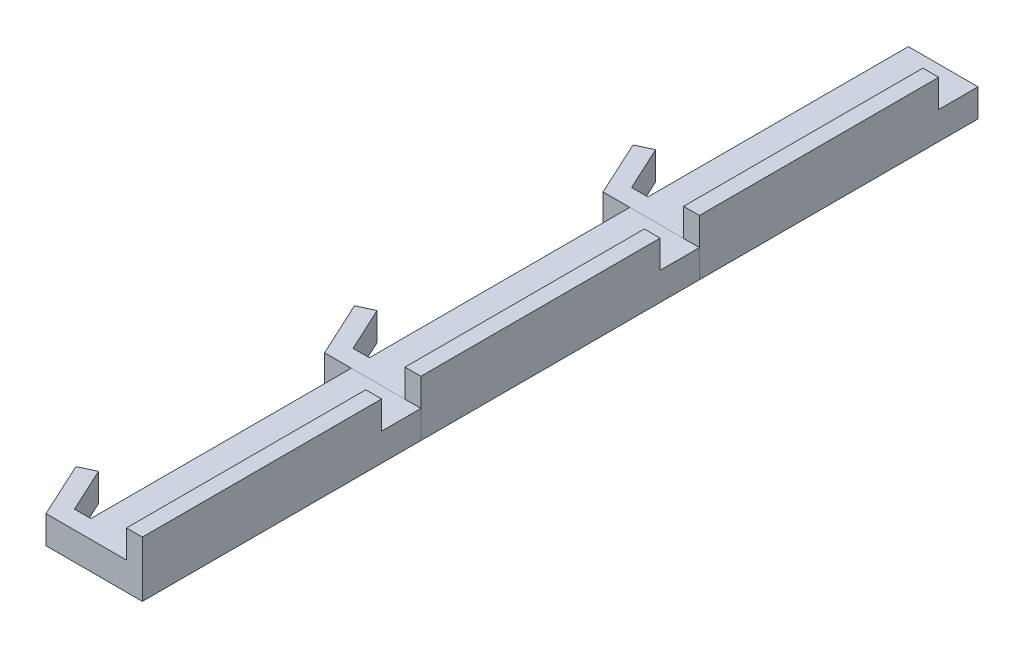
ISO-10303-21;
HEADER;
FILE_DESCRIPTION(('STEP AP214'),'2;1');
FILE_NAME('part.step','',(''),(''),'','','');
FILE_SCHEMA(('AUTOMOTIVE_DESIGN { 1 0 10303 214 1 1 1 1 }'));
ENDSEC;
DATA;
#1=APPLICATION_CONTEXT('core data for automotive mechanical design processes');
#2=APPLICATION_PROTOCOL_DEFINITION('international standard','automotive_design',2000,#1);
#3=PRODUCT_CONTEXT('',#1,'mechanical');
#4=PRODUCT('Part','Part','',(#3));
#5=PRODUCT_RELATED_PRODUCT_CATEGORY('part','',(#4));
#6=PRODUCT_DEFINITION_FORMATION('','',#4);
#7=PRODUCT_DEFINITION_CONTEXT('part definition',#1,'design');
#8=PRODUCT_DEFINITION('design','',#6,#7);
#9=PRODUCT_DEFINITION_SHAPE('','',#8);
#10=(LENGTH_UNIT() NAMED_UNIT(*) SI_UNIT(.MILLI.,.METRE.));
#11=(NAMED_UNIT(*) PLANE_ANGLE_UNIT() SI_UNIT($,.RADIAN.));
#12=(NAMED_UNIT(*) SI_UNIT($,.STERADIAN.) SOLID_ANGLE_UNIT());
#13=UNCERTAINTY_MEASURE_WITH_UNIT(LENGTH_MEASURE(1.E-05),#10,'distance_accuracy_value','');
#14=(GEOMETRIC_REPRESENTATION_CONTEXT(3) GLOBAL_UNCERTAINTY_ASSIGNED_CONTEXT((#13)) GLOBAL_UNIT_ASSIGNED_CONTEXT((#10,
#11,#12)) REPRESENTATION_CONTEXT('',''));
#15=CARTESIAN_POINT('',(0.,0.,0.));
#16=DIRECTION('',(0.,0.,1.));
#17=DIRECTION('',(1.,0.,0.));
#18=AXIS2_PLACEMENT_3D('',#15,#16,#17);
#19=CARTESIAN_POINT('',(0.,5.,-200.));
#20=DIRECTION('',(0.,-1.,0.));
#21=DIRECTION('',(0.,0.,-1.));
#22=AXIS2_PLACEMENT_3D('',#19,#20,#21);
#23=PLANE('',#22);
#24=DIRECTION('',(0.,0.,1.));
#25=VECTOR('',#24,1.);
#26=CARTESIAN_POINT('',(19.3056635281437,5.,-200.));
#27=LINE('',#26,#25);
#28=CARTESIAN_POINT('',(19.3056635281437,5.,-285.89851116357));
#29=VERTEX_POINT('',#28);
#30=CARTESIAN_POINT('',(19.3056635281437,5.,-200.));
#31=VERTEX_POINT('',#30);
#32=EDGE_CURVE('E152',#29,#31,#27,.T.);
#33=ORIENTED_EDGE('',*,*,#32,.F.);
#34=DIRECTION('',(-1.,0.,0.));
#35=VECTOR('',#34,1.);
#36=CARTESIAN_POINT('',(25.,5.,-285.89851116357));
#37=LINE('',#36,#35);
#38=CARTESIAN_POINT('',(25.,5.,-285.89851116357));
#39=VERTEX_POINT('',#38);
#40=EDGE_CURVE('E67',#39,#29,#37,.T.);
#41=ORIENTED_EDGE('',*,*,#40,.F.);
#42=DIRECTION('',(0.,0.,-1.));
#43=VECTOR('',#42,1.);
#44=CARTESIAN_POINT('',(25.,5.,-200.));
#45=LINE('',#44,#43);
#46=CARTESIAN_POINT('',(25.,5.,-300.));
#47=VERTEX_POINT('',#46);
#48=EDGE_CURVE('E156',#39,#47,#45,.T.);
#49=ORIENTED_EDGE('',*,*,#48,.T.);
#50=DIRECTION('',(-1.,0.,0.));
#51=VECTOR('',#50,1.);
#52=CARTESIAN_POINT('',(0.,5.,-300.));
#53=LINE('',#52,#51);
#54=CARTESIAN_POINT('',(0.,5.,-300.));
#55=VERTEX_POINT('',#54);
#56=EDGE_CURVE('E222',#47,#55,#53,.T.);
#57=ORIENTED_EDGE('',*,*,#56,.T.);
#58=DIRECTION('',(0.,0.,1.));
#59=VECTOR('',#58,1.);
#60=CARTESIAN_POINT('',(0.,5.,-200.));
#61=LINE('',#60,#59);
#62=CARTESIAN_POINT('',(0.,5.,-206.505696114862));
#63=VERTEX_POINT('',#62);
#64=EDGE_CURVE('E217',#55,#63,#61,.T.);
#65=ORIENTED_EDGE('',*,*,#64,.T.);
#66=DIRECTION('',(-1.,0.,0.));
#67=VECTOR('',#66,1.);
#68=CARTESIAN_POINT('',(-5.86936831603831,5.,-206.505696114862));
#69=LINE('',#68,#67);
#70=CARTESIAN_POINT('',(-5.86936831603831,5.,-206.505696114862));
#71=VERTEX_POINT('',#70);
#72=EDGE_CURVE('E157',#63,#71,#69,.T.);
#73=ORIENTED_EDGE('',*,*,#72,.T.);
#74=DIRECTION('',(-0.419954440524042,0.,-0.907545187791847));
#75=VECTOR('',#74,1.);
#76=CARTESIAN_POINT('',(-13.2983834469383,5.,-222.560216037708));
#77=LINE('',#76,#75);
#78=CARTESIAN_POINT('',(-13.2983834469383,5.,-222.560216037708));
#79=VERTEX_POINT('',#78);
#80=EDGE_CURVE('E160',#71,#79,#77,.T.);
#81=ORIENTED_EDGE('',*,*,#80,.T.);
#82=DIRECTION('',(-0.907545187791847,0.,0.419954440524042));
#83=VECTOR('',#82,1.);
#84=CARTESIAN_POINT('',(-18.8458423088671,5.,-219.993203381997));
#85=LINE('',#84,#83);
#86=CARTESIAN_POINT('',(-18.8458423088671,5.,-219.993203381997));
#87=VERTEX_POINT('',#86);
#88=EDGE_CURVE('E178',#79,#87,#85,.T.);
#89=ORIENTED_EDGE('',*,*,#88,.T.);
#90=DIRECTION('',(0.419954440524043,0.,0.907545187791847));
#91=VECTOR('',#90,1.);
#92=CARTESIAN_POINT('',(-9.59425389925973,5.,-200.));
#93=LINE('',#92,#91);
#94=CARTESIAN_POINT('',(-9.59425389925973,5.,-200.));
#95=VERTEX_POINT('',#94);
#96=EDGE_CURVE('E175',#87,#95,#93,.T.);
#97=ORIENTED_EDGE('',*,*,#96,.T.);
#98=DIRECTION('',(1.,0.,0.));
#99=VECTOR('',#98,1.);
#100=CARTESIAN_POINT('',(0.,5.,-200.));
#101=LINE('',#100,#99);
#102=EDGE_CURVE('E73',#95,#31,#101,.T.);
#103=ORIENTED_EDGE('',*,*,#102,.T.);
#104=EDGE_LOOP('',(#33,#41,#49,#57,#65,#73,#81,#89,#97,#103));
#105=FACE_BOUND('',#104,.T.);
#106=ADVANCED_FACE('F50',(#105),#23,.F.);
#107=CARTESIAN_POINT('',(0.,5.,-200.));
#108=DIRECTION('',(1.,0.,0.));
#109=DIRECTION('',(0.,0.,-1.));
#110=AXIS2_PLACEMENT_3D('',#107,#108,#109);
#111=PLANE('',#110);
#112=DIRECTION('',(0.,0.,1.));
#113=VECTOR('',#112,1.);
#114=CARTESIAN_POINT('',(0.,-5.,-200.));
#115=LINE('',#114,#113);
#116=CARTESIAN_POINT('',(0.,-5.,-300.));
#117=VERTEX_POINT('',#116);
#118=CARTESIAN_POINT('',(0.,-5.,-206.505696114862));
#119=VERTEX_POINT('',#118);
#120=EDGE_CURVE('E210',#117,#119,#115,.T.);
#121=ORIENTED_EDGE('',*,*,#120,.T.);
#122=DIRECTION('',(0.,1.,0.));
#123=VECTOR('',#122,1.);
#124=CARTESIAN_POINT('',(0.,-34.3960732071268,-206.505696114862));
#125=LINE('',#124,#123);
#126=EDGE_CURVE('E198',#119,#63,#125,.T.);
#127=ORIENTED_EDGE('',*,*,#126,.T.);
#128=ORIENTED_EDGE('',*,*,#64,.F.);
#129=DIRECTION('',(0.,-1.,0.));
#130=VECTOR('',#129,1.);
#131=CARTESIAN_POINT('',(0.,5.,-300.));
#132=LINE('',#131,#130);
#133=EDGE_CURVE('E224',#55,#117,#132,.T.);
#134=ORIENTED_EDGE('',*,*,#133,.T.);
#135=EDGE_LOOP('',(#121,#127,#128,#134));
#136=FACE_BOUND('',#135,.T.);
#137=ADVANCED_FACE('F52',(#136),#111,.F.);
#138=CARTESIAN_POINT('',(0.,5.,-200.));
#139=DIRECTION('',(0.,0.,-1.));
#140=DIRECTION('',(-1.,0.,0.));
#141=AXIS2_PLACEMENT_3D('',#138,#139,#140);
#142=PLANE('',#141);
#143=DIRECTION('',(1.,0.,0.));
#144=VECTOR('',#143,1.);
#145=CARTESIAN_POINT('',(0.,-5.,-200.));
#146=LINE('',#145,#144);
#147=CARTESIAN_POINT('',(-9.59425389925973,-5.,-200.));
#148=VERTEX_POINT('',#147);
#149=CARTESIAN_POINT('',(25.,-5.,-200.));
#150=VERTEX_POINT('',#149);
#151=EDGE_CURVE('E227',#148,#150,#146,.T.);
#152=ORIENTED_EDGE('',*,*,#151,.T.);
#153=DIRECTION('',(0.,-1.,0.));
#154=VECTOR('',#153,1.);
#155=CARTESIAN_POINT('',(25.,5.,-200.));
#156=LINE('',#155,#154);
#157=CARTESIAN_POINT('',(25.,15.,-200.));
#158=VERTEX_POINT('',#157);
#159=EDGE_CURVE('E12',#158,#150,#156,.T.);
#160=ORIENTED_EDGE('',*,*,#159,.F.);
#161=DIRECTION('',(1.,0.,0.));
#162=VECTOR('',#161,1.);
#163=CARTESIAN_POINT('',(25.,15.,-200.));
#164=LINE('',#163,#162);
#165=CARTESIAN_POINT('',(19.3056635281437,15.,-200.));
#166=VERTEX_POINT('',#165);
#167=EDGE_CURVE('E150',#166,#158,#164,.T.);
#168=ORIENTED_EDGE('',*,*,#167,.F.);
#169=DIRECTION('',(0.,-1.,0.));
#170=VECTOR('',#169,1.);
#171=CARTESIAN_POINT('',(19.3056635281437,15.,-200.));
#172=LINE('',#171,#170);
#173=EDGE_CURVE('E162',#166,#31,#172,.T.);
#174=ORIENTED_EDGE('',*,*,#173,.T.);
#175=ORIENTED_EDGE('',*,*,#102,.F.);
#176=DIRECTION('',(0.,1.,0.));
#177=VECTOR('',#176,1.);
#178=CARTESIAN_POINT('',(-9.59425389925973,-34.3960732071268,-200.));
#179=LINE('',#178,#177);
#180=EDGE_CURVE('E186',#148,#95,#179,.T.);
#181=ORIENTED_EDGE('',*,*,#180,.F.);
#182=EDGE_LOOP('',(#152,#160,#168,#174,#175,#181));
#183=FACE_BOUND('',#182,.T.);
#184=ADVANCED_FACE('F268',(#183),#142,.F.);
#185=CARTESIAN_POINT('',(25.,5.,-200.));
#186=DIRECTION('',(-1.,0.,0.));
#187=DIRECTION('',(0.,0.,1.));
#188=AXIS2_PLACEMENT_3D('',#185,#186,#187);
#189=PLANE('',#188);
#190=DIRECTION('',(0.,0.,-1.));
#191=VECTOR('',#190,1.);
#192=CARTESIAN_POINT('',(25.,-5.,-200.));
#193=LINE('',#192,#191);
#194=CARTESIAN_POINT('',(25.,-5.,-300.));
#195=VERTEX_POINT('',#194);
#196=EDGE_CURVE('E236',#150,#195,#193,.T.);
#197=ORIENTED_EDGE('',*,*,#196,.T.);
#198=DIRECTION('',(0.,-1.,0.));
#199=VECTOR('',#198,1.);
#200=CARTESIAN_POINT('',(25.,5.,-300.));
#201=LINE('',#200,#199);
#202=EDGE_CURVE('E59',#47,#195,#201,.T.);
#203=ORIENTED_EDGE('',*,*,#202,.F.);
#204=ORIENTED_EDGE('',*,*,#48,.F.);
#205=DIRECTION('',(0.,-1.,0.));
#206=VECTOR('',#205,1.);
#207=CARTESIAN_POINT('',(25.,15.,-285.89851116357));
#208=LINE('',#207,#206);
#209=CARTESIAN_POINT('',(25.,15.,-285.89851116357));
#210=VERTEX_POINT('',#209);
#211=EDGE_CURVE('E138',#210,#39,#208,.T.);
#212=ORIENTED_EDGE('',*,*,#211,.F.);
#213=DIRECTION('',(0.,0.,-1.));
#214=VECTOR('',#213,1.);
#215=CARTESIAN_POINT('',(25.,15.,-200.));
#216=LINE('',#215,#214);
#217=EDGE_CURVE('E144',#158,#210,#216,.T.);
#218=ORIENTED_EDGE('',*,*,#217,.F.);
#219=ORIENTED_EDGE('',*,*,#159,.T.);
#220=EDGE_LOOP('',(#197,#203,#204,#212,#218,#219));
#221=FACE_BOUND('',#220,.T.);
#222=ADVANCED_FACE('F154',(#221),#189,.F.);
#223=CARTESIAN_POINT('',(0.,5.,-300.));
#224=DIRECTION('',(0.,0.,1.));
#225=DIRECTION('',(1.,0.,0.));
#226=AXIS2_PLACEMENT_3D('',#223,#224,#225);
#227=PLANE('',#226);
#228=DIRECTION('',(-1.,0.,0.));
#229=VECTOR('',#228,1.);
#230=CARTESIAN_POINT('',(0.,-5.,-300.));
#231=LINE('',#230,#229);
#232=EDGE_CURVE('E234',#195,#117,#231,.T.);
#233=ORIENTED_EDGE('',*,*,#232,.T.);
#234=ORIENTED_EDGE('',*,*,#133,.F.);
#235=ORIENTED_EDGE('',*,*,#56,.F.);
#236=ORIENTED_EDGE('',*,*,#202,.T.);
#237=EDGE_LOOP('',(#233,#234,#235,#236));
#238=FACE_BOUND('',#237,.T.);
#239=ADVANCED_FACE('F245',(#238),#227,.F.);
#240=CARTESIAN_POINT('',(0.,-5.,-200.));
#241=DIRECTION('',(0.,-1.,0.));
#242=DIRECTION('',(0.,0.,-1.));
#243=AXIS2_PLACEMENT_3D('',#240,#241,#242);
#244=PLANE('',#243);
#245=ORIENTED_EDGE('',*,*,#120,.F.);
#246=ORIENTED_EDGE('',*,*,#232,.F.);
#247=ORIENTED_EDGE('',*,*,#196,.F.);
#248=ORIENTED_EDGE('',*,*,#151,.F.);
#249=DIRECTION('',(0.419954440524043,0.,0.907545187791847));
#250=VECTOR('',#249,1.);
#251=CARTESIAN_POINT('',(-9.59425389925973,-5.,-200.));
#252=LINE('',#251,#250);
#253=CARTESIAN_POINT('',(-18.8458423088671,-5.,-219.993203381997));
#254=VERTEX_POINT('',#253);
#255=EDGE_CURVE('E183',#254,#148,#252,.T.);
#256=ORIENTED_EDGE('',*,*,#255,.F.);
#257=DIRECTION('',(-0.907545187791847,0.,0.419954440524043));
#258=VECTOR('',#257,1.);
#259=CARTESIAN_POINT('',(-18.8458423088671,-5.,-219.993203381997));
#260=LINE('',#259,#258);
#261=CARTESIAN_POINT('',(-13.2983834469383,-5.,-222.560216037708));
#262=VERTEX_POINT('',#261);
#263=EDGE_CURVE('E188',#262,#254,#260,.T.);
#264=ORIENTED_EDGE('',*,*,#263,.F.);
#265=DIRECTION('',(-0.419954440524043,0.,-0.907545187791847));
#266=VECTOR('',#265,1.);
#267=CARTESIAN_POINT('',(-13.2983834469383,-5.,-222.560216037708));
#268=LINE('',#267,#266);
#269=CARTESIAN_POINT('',(-5.86936831603831,-5.,-206.505696114862));
#270=VERTEX_POINT('',#269);
#271=EDGE_CURVE('E192',#270,#262,#268,.T.);
#272=ORIENTED_EDGE('',*,*,#271,.F.);
#273=DIRECTION('',(-1.,0.,0.));
#274=VECTOR('',#273,1.);
#275=CARTESIAN_POINT('',(-5.86936831603831,-5.,-206.505696114862));
#276=LINE('',#275,#274);
#277=EDGE_CURVE('E177',#119,#270,#276,.T.);
#278=ORIENTED_EDGE('',*,*,#277,.F.);
#279=EDGE_LOOP('',(#245,#246,#247,#248,#256,#264,#272,#278));
#280=FACE_BOUND('',#279,.T.);
#281=ADVANCED_FACE('F249',(#280),#244,.T.);
#282=CARTESIAN_POINT('',(-5.86936831603831,-34.3960732071268,-206.505696114862));
#283=DIRECTION('',(0.,0.,-1.));
#284=DIRECTION('',(-1.,0.,0.));
#285=AXIS2_PLACEMENT_3D('',#282,#283,#284);
#286=PLANE('',#285);
#287=ORIENTED_EDGE('',*,*,#126,.F.);
#288=ORIENTED_EDGE('',*,*,#277,.T.);
#289=DIRECTION('',(0.,1.,0.));
#290=VECTOR('',#289,1.);
#291=CARTESIAN_POINT('',(-5.86936831603831,-34.3960732071268,-206.505696114862));
#292=LINE('',#291,#290);
#293=EDGE_CURVE('E195',#270,#71,#292,.T.);
#294=ORIENTED_EDGE('',*,*,#293,.T.);
#295=ORIENTED_EDGE('',*,*,#72,.F.);
#296=EDGE_LOOP('',(#287,#288,#294,#295));
#297=FACE_BOUND('',#296,.T.);
#298=ADVANCED_FACE('F253',(#297),#286,.T.);
#299=CARTESIAN_POINT('',(-13.2983834469383,-34.3960732071268,-222.560216037708));
#300=DIRECTION('',(0.907545187791847,0.,-0.419954440524042));
#301=DIRECTION('',(-0.419954440524043,0.,-0.907545187791847));
#302=AXIS2_PLACEMENT_3D('',#299,#300,#301);
#303=PLANE('',#302);
#304=ORIENTED_EDGE('',*,*,#293,.F.);
#305=ORIENTED_EDGE('',*,*,#271,.T.);
#306=DIRECTION('',(0.,1.,0.));
#307=VECTOR('',#306,1.);
#308=CARTESIAN_POINT('',(-13.2983834469383,-34.3960732071268,-222.560216037708));
#309=LINE('',#308,#307);
#310=EDGE_CURVE('E191',#262,#79,#309,.T.);
#311=ORIENTED_EDGE('',*,*,#310,.T.);
#312=ORIENTED_EDGE('',*,*,#80,.F.);
#313=EDGE_LOOP('',(#304,#305,#311,#312));
#314=FACE_BOUND('',#313,.T.);
#315=ADVANCED_FACE('F258',(#314),#303,.T.);
#316=CARTESIAN_POINT('',(-18.8458423088671,-34.3960732071268,-219.993203381997));
#317=DIRECTION('',(-0.419954440524042,0.,-0.907545187791847));
#318=DIRECTION('',(-0.907545187791847,0.,0.419954440524043));
#319=AXIS2_PLACEMENT_3D('',#316,#317,#318);
#320=PLANE('',#319);
#321=ORIENTED_EDGE('',*,*,#310,.F.);
#322=ORIENTED_EDGE('',*,*,#263,.T.);
#323=DIRECTION('',(0.,1.,0.));
#324=VECTOR('',#323,1.);
#325=CARTESIAN_POINT('',(-18.8458423088671,-34.3960732071268,-219.993203381997));
#326=LINE('',#325,#324);
#327=EDGE_CURVE('E187',#254,#87,#326,.T.);
#328=ORIENTED_EDGE('',*,*,#327,.T.);
#329=ORIENTED_EDGE('',*,*,#88,.F.);
#330=EDGE_LOOP('',(#321,#322,#328,#329));
#331=FACE_BOUND('',#330,.T.);
#332=ADVANCED_FACE('F261',(#331),#320,.T.);
#333=CARTESIAN_POINT('',(-9.59425389925973,-34.3960732071268,-200.));
#334=DIRECTION('',(-0.907545187791847,0.,0.419954440524043));
#335=DIRECTION('',(0.419954440524043,0.,0.907545187791847));
#336=AXIS2_PLACEMENT_3D('',#333,#334,#335);
#337=PLANE('',#336);
#338=ORIENTED_EDGE('',*,*,#327,.F.);
#339=ORIENTED_EDGE('',*,*,#255,.T.);
#340=ORIENTED_EDGE('',*,*,#180,.T.);
#341=ORIENTED_EDGE('',*,*,#96,.F.);
#342=EDGE_LOOP('',(#338,#339,#340,#341));
#343=FACE_BOUND('',#342,.T.);
#344=ADVANCED_FACE('F265',(#343),#337,.T.);
#345=CARTESIAN_POINT('',(25.,15.,-285.89851116357));
#346=DIRECTION('',(0.,0.,1.));
#347=DIRECTION('',(1.,0.,0.));
#348=AXIS2_PLACEMENT_3D('',#345,#346,#347);
#349=PLANE('',#348);
#350=ORIENTED_EDGE('',*,*,#40,.T.);
#351=DIRECTION('',(0.,-1.,0.));
#352=VECTOR('',#351,1.);
#353=CARTESIAN_POINT('',(19.3056635281437,15.,-285.89851116357));
#354=LINE('',#353,#352);
#355=CARTESIAN_POINT('',(19.3056635281437,15.,-285.89851116357));
#356=VERTEX_POINT('',#355);
#357=EDGE_CURVE('E140',#356,#29,#354,.T.);
#358=ORIENTED_EDGE('',*,*,#357,.F.);
#359=DIRECTION('',(-1.,0.,0.));
#360=VECTOR('',#359,1.);
#361=CARTESIAN_POINT('',(25.,15.,-285.89851116357));
#362=LINE('',#361,#360);
#363=EDGE_CURVE('E134',#210,#356,#362,.T.);
#364=ORIENTED_EDGE('',*,*,#363,.F.);
#365=ORIENTED_EDGE('',*,*,#211,.T.);
#366=EDGE_LOOP('',(#350,#358,#364,#365));
#367=FACE_BOUND('',#366,.T.);
#368=ADVANCED_FACE('F136',(#367),#349,.F.);
#369=CARTESIAN_POINT('',(19.3056635281437,15.,-200.));
#370=DIRECTION('',(1.,0.,0.));
#371=DIRECTION('',(0.,0.,-1.));
#372=AXIS2_PLACEMENT_3D('',#369,#370,#371);
#373=PLANE('',#372);
#374=ORIENTED_EDGE('',*,*,#32,.T.);
#375=ORIENTED_EDGE('',*,*,#173,.F.);
#376=DIRECTION('',(0.,0.,1.));
#377=VECTOR('',#376,1.);
#378=CARTESIAN_POINT('',(19.3056635281437,15.,-200.));
#379=LINE('',#378,#377);
#380=EDGE_CURVE('E143',#356,#166,#379,.T.);
#381=ORIENTED_EDGE('',*,*,#380,.F.);
#382=ORIENTED_EDGE('',*,*,#357,.T.);
#383=EDGE_LOOP('',(#374,#375,#381,#382));
#384=FACE_BOUND('',#383,.T.);
#385=ADVANCED_FACE('F272',(#384),#373,.F.);
#386=CARTESIAN_POINT('',(0.,15.,-200.));
#387=DIRECTION('',(0.,1.,0.));
#388=DIRECTION('',(0.,0.,1.));
#389=AXIS2_PLACEMENT_3D('',#386,#387,#388);
#390=PLANE('',#389);
#391=ORIENTED_EDGE('',*,*,#217,.T.);
#392=ORIENTED_EDGE('',*,*,#363,.T.);
#393=ORIENTED_EDGE('',*,*,#380,.T.);
#394=ORIENTED_EDGE('',*,*,#167,.T.);
#395=EDGE_LOOP('',(#391,#392,#393,#394));
#396=FACE_BOUND('',#395,.T.);
#397=ADVANCED_FACE('F148',(#396),#390,.T.);
#398=CLOSED_SHELL('',(#106,#137,#184,#222,#239,#281,#298,#315,#332,#344,#368,#385,#397));
#399=MANIFOLD_SOLID_BREP('B2',#398);
#400=CARTESIAN_POINT('',(0.,5.,-100.));
#401=DIRECTION('',(0.,-1.,0.));
#402=DIRECTION('',(0.,0.,-1.));
#403=AXIS2_PLACEMENT_3D('',#400,#401,#402);
#404=PLANE('',#403);
#405=DIRECTION('',(0.,0.,1.));
#406=VECTOR('',#405,1.);
#407=CARTESIAN_POINT('',(19.3056635281437,5.,-100.));
#408=LINE('',#407,#406);
#409=CARTESIAN_POINT('',(19.3056635281437,5.,-185.89851116357));
#410=VERTEX_POINT('',#409);
#411=CARTESIAN_POINT('',(19.3056635281437,5.,-100.));
#412=VERTEX_POINT('',#411);
#413=EDGE_CURVE('E507',#410,#412,#408,.T.);
#414=ORIENTED_EDGE('',*,*,#413,.F.);
#415=DIRECTION('',(-1.,0.,0.));
#416=VECTOR('',#415,1.);
#417=CARTESIAN_POINT('',(25.,5.,-185.89851116357));
#418=LINE('',#417,#416);
#419=CARTESIAN_POINT('',(25.,5.,-185.89851116357));
#420=VERTEX_POINT('',#419);
#421=EDGE_CURVE('E420',#420,#410,#418,.T.);
#422=ORIENTED_EDGE('',*,*,#421,.F.);
#423=DIRECTION('',(0.,0.,-1.));
#424=VECTOR('',#423,1.);
#425=CARTESIAN_POINT('',(25.,5.,-100.));
#426=LINE('',#425,#424);
#427=CARTESIAN_POINT('',(25.,5.,-200.));
#428=VERTEX_POINT('',#427);
#429=EDGE_CURVE('E511',#420,#428,#426,.T.);
#430=ORIENTED_EDGE('',*,*,#429,.T.);
#431=DIRECTION('',(-1.,0.,0.));
#432=VECTOR('',#431,1.);
#433=CARTESIAN_POINT('',(0.,5.,-200.));
#434=LINE('',#433,#432);
#435=CARTESIAN_POINT('',(0.,5.,-200.));
#436=VERTEX_POINT('',#435);
#437=EDGE_CURVE('E594',#428,#436,#434,.T.);
#438=ORIENTED_EDGE('',*,*,#437,.T.);
#439=DIRECTION('',(0.,0.,1.));
#440=VECTOR('',#439,1.);
#441=CARTESIAN_POINT('',(0.,5.,-100.));
#442=LINE('',#441,#440);
#443=CARTESIAN_POINT('',(0.,5.,-106.505696114862));
#444=VERTEX_POINT('',#443);
#445=EDGE_CURVE('E589',#436,#444,#442,.T.);
#446=ORIENTED_EDGE('',*,*,#445,.T.);
#447=DIRECTION('',(-1.,0.,0.));
#448=VECTOR('',#447,1.);
#449=CARTESIAN_POINT('',(-5.86936831603831,5.,-106.505696114862));
#450=LINE('',#449,#448);
#451=CARTESIAN_POINT('',(-5.86936831603831,5.,-106.505696114862));
#452=VERTEX_POINT('',#451);
#453=EDGE_CURVE('E513',#444,#452,#450,.T.);
#454=ORIENTED_EDGE('',*,*,#453,.T.);
#455=DIRECTION('',(-0.419954440524042,0.,-0.907545187791847));
#456=VECTOR('',#455,1.);
#457=CARTESIAN_POINT('',(-13.2983834469383,5.,-122.560216037708));
#458=LINE('',#457,#456);
#459=CARTESIAN_POINT('',(-13.2983834469383,5.,-122.560216037708));
#460=VERTEX_POINT('',#459);
#461=EDGE_CURVE('E518',#452,#460,#458,.T.);
#462=ORIENTED_EDGE('',*,*,#461,.T.);
#463=DIRECTION('',(-0.907545187791847,0.,0.419954440524042));
#464=VECTOR('',#463,1.);
#465=CARTESIAN_POINT('',(-18.8458423088671,5.,-119.993203381997));
#466=LINE('',#465,#464);
#467=CARTESIAN_POINT('',(-18.8458423088671,5.,-119.993203381997));
#468=VERTEX_POINT('',#467);
#469=EDGE_CURVE('E538',#460,#468,#466,.T.);
#470=ORIENTED_EDGE('',*,*,#469,.T.);
#471=DIRECTION('',(0.419954440524043,0.,0.907545187791847));
#472=VECTOR('',#471,1.);
#473=CARTESIAN_POINT('',(-9.59425389925973,5.,-100.));
#474=LINE('',#473,#472);
#475=CARTESIAN_POINT('',(-9.59425389925973,5.,-100.));
#476=VERTEX_POINT('',#475);
#477=EDGE_CURVE('E534',#468,#476,#474,.T.);
#478=ORIENTED_EDGE('',*,*,#477,.T.);
#479=DIRECTION('',(1.,0.,0.));
#480=VECTOR('',#479,1.);
#481=CARTESIAN_POINT('',(0.,5.,-100.));
#482=LINE('',#481,#480);
#483=EDGE_CURVE('E426',#476,#412,#482,.T.);
#484=ORIENTED_EDGE('',*,*,#483,.T.);
#485=EDGE_LOOP('',(#414,#422,#430,#438,#446,#454,#462,#470,#478,#484));
#486=FACE_BOUND('',#485,.T.);
#487=ADVANCED_FACE('F402',(#486),#404,.F.);
#488=CARTESIAN_POINT('',(0.,5.,-100.));
#489=DIRECTION('',(1.,0.,0.));
#490=DIRECTION('',(0.,0.,-1.));
#491=AXIS2_PLACEMENT_3D('',#488,#489,#490);
#492=PLANE('',#491);
#493=DIRECTION('',(0.,0.,1.));
#494=VECTOR('',#493,1.);
#495=CARTESIAN_POINT('',(0.,-5.,-100.));
#496=LINE('',#495,#494);
#497=CARTESIAN_POINT('',(0.,-5.,-200.));
#498=VERTEX_POINT('',#497);
#499=CARTESIAN_POINT('',(0.,-5.,-106.505696114862));
#500=VERTEX_POINT('',#499);
#501=EDGE_CURVE('E580',#498,#500,#496,.T.);
#502=ORIENTED_EDGE('',*,*,#501,.T.);
#503=DIRECTION('',(0.,1.,0.));
#504=VECTOR('',#503,1.);
#505=CARTESIAN_POINT('',(0.,-34.3960732071268,-106.505696114862));
#506=LINE('',#505,#504);
#507=EDGE_CURVE('E564',#500,#444,#506,.T.);
#508=ORIENTED_EDGE('',*,*,#507,.T.);
#509=ORIENTED_EDGE('',*,*,#445,.F.);
#510=DIRECTION('',(0.,-1.,0.));
#511=VECTOR('',#510,1.);
#512=CARTESIAN_POINT('',(0.,5.,-200.));
#513=LINE('',#512,#511);
#514=EDGE_CURVE('E597',#436,#498,#513,.T.);
#515=ORIENTED_EDGE('',*,*,#514,.T.);
#516=EDGE_LOOP('',(#502,#508,#509,#515));
#517=FACE_BOUND('',#516,.T.);
#518=ADVANCED_FACE('F404',(#517),#492,.F.);
#519=CARTESIAN_POINT('',(0.,5.,-100.));
#520=DIRECTION('',(0.,0.,-1.));
#521=DIRECTION('',(-1.,0.,0.));
#522=AXIS2_PLACEMENT_3D('',#519,#520,#521);
#523=PLANE('',#522);
#524=DIRECTION('',(1.,0.,0.));
#525=VECTOR('',#524,1.);
#526=CARTESIAN_POINT('',(0.,-5.,-100.));
#527=LINE('',#526,#525);
#528=CARTESIAN_POINT('',(-9.59425389925973,-5.,-100.));
#529=VERTEX_POINT('',#528);
#530=CARTESIAN_POINT('',(25.,-5.,-100.));
#531=VERTEX_POINT('',#530);
#532=EDGE_CURVE('E600',#529,#531,#527,.T.);
#533=ORIENTED_EDGE('',*,*,#532,.T.);
#534=DIRECTION('',(0.,-1.,0.));
#535=VECTOR('',#534,1.);
#536=CARTESIAN_POINT('',(25.,5.,-100.));
#537=LINE('',#536,#535);
#538=CARTESIAN_POINT('',(25.,15.,-100.));
#539=VERTEX_POINT('',#538);
#540=EDGE_CURVE('E48',#539,#531,#537,.T.);
#541=ORIENTED_EDGE('',*,*,#540,.F.);
#542=DIRECTION('',(1.,0.,0.));
#543=VECTOR('',#542,1.);
#544=CARTESIAN_POINT('',(25.,15.,-100.));
#545=LINE('',#544,#543);
#546=CARTESIAN_POINT('',(19.3056635281437,15.,-100.));
#547=VERTEX_POINT('',#546);
#548=EDGE_CURVE('E504',#547,#539,#545,.T.);
#549=ORIENTED_EDGE('',*,*,#548,.F.);
#550=DIRECTION('',(0.,-1.,0.));
#551=VECTOR('',#550,1.);
#552=CARTESIAN_POINT('',(19.3056635281437,15.,-100.));
#553=LINE('',#552,#551);
#554=EDGE_CURVE('E520',#547,#412,#553,.T.);
#555=ORIENTED_EDGE('',*,*,#554,.T.);
#556=ORIENTED_EDGE('',*,*,#483,.F.);
#557=DIRECTION('',(0.,1.,0.));
#558=VECTOR('',#557,1.);
#559=CARTESIAN_POINT('',(-9.59425389925973,-34.3960732071268,-100.));
#560=LINE('',#559,#558);
#561=EDGE_CURVE('E549',#529,#476,#560,.T.);
#562=ORIENTED_EDGE('',*,*,#561,.F.);
#563=EDGE_LOOP('',(#533,#541,#549,#555,#556,#562));
#564=FACE_BOUND('',#563,.T.);
#565=ADVANCED_FACE('F647',(#564),#523,.F.);
#566=CARTESIAN_POINT('',(25.,5.,-100.));
#567=DIRECTION('',(-1.,0.,0.));
#568=DIRECTION('',(0.,0.,1.));
#569=AXIS2_PLACEMENT_3D('',#566,#567,#568);
#570=PLANE('',#569);
#571=DIRECTION('',(0.,0.,-1.));
#572=VECTOR('',#571,1.);
#573=CARTESIAN_POINT('',(25.,-5.,-100.));
#574=LINE('',#573,#572);
#575=CARTESIAN_POINT('',(25.,-5.,-200.));
#576=VERTEX_POINT('',#575);
#577=EDGE_CURVE('E612',#531,#576,#574,.T.);
#578=ORIENTED_EDGE('',*,*,#577,.T.);
#579=DIRECTION('',(0.,-1.,0.));
#580=VECTOR('',#579,1.);
#581=CARTESIAN_POINT('',(25.,5.,-200.));
#582=LINE('',#581,#580);
#583=EDGE_CURVE('E412',#428,#576,#582,.T.);
#584=ORIENTED_EDGE('',*,*,#583,.F.);
#585=ORIENTED_EDGE('',*,*,#429,.F.);
#586=DIRECTION('',(0.,-1.,0.));
#587=VECTOR('',#586,1.);
#588=CARTESIAN_POINT('',(25.,15.,-185.89851116357));
#589=LINE('',#588,#587);
#590=CARTESIAN_POINT('',(25.,15.,-185.89851116357));
#591=VERTEX_POINT('',#590);
#592=EDGE_CURVE('E491',#591,#420,#589,.T.);
#593=ORIENTED_EDGE('',*,*,#592,.F.);
#594=DIRECTION('',(0.,0.,-1.));
#595=VECTOR('',#594,1.);
#596=CARTESIAN_POINT('',(25.,15.,-100.));
#597=LINE('',#596,#595);
#598=EDGE_CURVE('E498',#539,#591,#597,.T.);
#599=ORIENTED_EDGE('',*,*,#598,.F.);
#600=ORIENTED_EDGE('',*,*,#540,.T.);
#601=EDGE_LOOP('',(#578,#584,#585,#593,#599,#600));
#602=FACE_BOUND('',#601,.T.);
#603=ADVANCED_FACE('F509',(#602),#570,.F.);
#604=CARTESIAN_POINT('',(0.,5.,-200.));
#605=DIRECTION('',(0.,0.,1.));
#606=DIRECTION('',(1.,0.,0.));
#607=AXIS2_PLACEMENT_3D('',#604,#605,#606);
#608=PLANE('',#607);
#609=DIRECTION('',(-1.,0.,0.));
#610=VECTOR('',#609,1.);
#611=CARTESIAN_POINT('',(0.,-5.,-200.));
#612=LINE('',#611,#610);
#613=EDGE_CURVE('E609',#576,#498,#612,.T.);
#614=ORIENTED_EDGE('',*,*,#613,.T.);
#615=ORIENTED_EDGE('',*,*,#514,.F.);
#616=ORIENTED_EDGE('',*,*,#437,.F.);
#617=ORIENTED_EDGE('',*,*,#583,.T.);
#618=EDGE_LOOP('',(#614,#615,#616,#617));
#619=FACE_BOUND('',#618,.T.);
#620=ADVANCED_FACE('F624',(#619),#608,.F.);
#621=CARTESIAN_POINT('',(0.,-5.,-100.));
#622=DIRECTION('',(0.,-1.,0.));
#623=DIRECTION('',(0.,0.,-1.));
#624=AXIS2_PLACEMENT_3D('',#621,#622,#623);
#625=PLANE('',#624);
#626=ORIENTED_EDGE('',*,*,#501,.F.);
#627=ORIENTED_EDGE('',*,*,#613,.F.);
#628=ORIENTED_EDGE('',*,*,#577,.F.);
#629=ORIENTED_EDGE('',*,*,#532,.F.);
#630=DIRECTION('',(0.419954440524043,0.,0.907545187791847));
#631=VECTOR('',#630,1.);
#632=CARTESIAN_POINT('',(-9.59425389925973,-5.,-100.));
#633=LINE('',#632,#631);
#634=CARTESIAN_POINT('',(-18.8458423088671,-5.,-119.993203381997));
#635=VERTEX_POINT('',#634);
#636=EDGE_CURVE('E545',#635,#529,#633,.T.);
#637=ORIENTED_EDGE('',*,*,#636,.F.);
#638=DIRECTION('',(-0.907545187791847,0.,0.419954440524043));
#639=VECTOR('',#638,1.);
#640=CARTESIAN_POINT('',(-18.8458423088671,-5.,-119.993203381997));
#641=LINE('',#640,#639);
#642=CARTESIAN_POINT('',(-13.2983834469383,-5.,-122.560216037708));
#643=VERTEX_POINT('',#642);
#644=EDGE_CURVE('E551',#643,#635,#641,.T.);
#645=ORIENTED_EDGE('',*,*,#644,.F.);
#646=DIRECTION('',(-0.419954440524043,0.,-0.907545187791847));
#647=VECTOR('',#646,1.);
#648=CARTESIAN_POINT('',(-13.2983834469383,-5.,-122.560216037708));
#649=LINE('',#648,#647);
#650=CARTESIAN_POINT('',(-5.86936831603831,-5.,-106.505696114862));
#651=VERTEX_POINT('',#650);
#652=EDGE_CURVE('E556',#651,#643,#649,.T.);
#653=ORIENTED_EDGE('',*,*,#652,.F.);
#654=DIRECTION('',(-1.,0.,0.));
#655=VECTOR('',#654,1.);
#656=CARTESIAN_POINT('',(-5.86936831603831,-5.,-106.505696114862));
#657=LINE('',#656,#655);
#658=EDGE_CURVE('E537',#500,#651,#657,.T.);
#659=ORIENTED_EDGE('',*,*,#658,.F.);
#660=EDGE_LOOP('',(#626,#627,#628,#629,#637,#645,#653,#659));
#661=FACE_BOUND('',#660,.T.);
#662=ADVANCED_FACE('F628',(#661),#625,.T.);
#663=CARTESIAN_POINT('',(-5.86936831603831,-34.3960732071268,-106.505696114862));
#664=DIRECTION('',(0.,0.,-1.));
#665=DIRECTION('',(-1.,0.,0.));
#666=AXIS2_PLACEMENT_3D('',#663,#664,#665);
#667=PLANE('',#666);
#668=ORIENTED_EDGE('',*,*,#507,.F.);
#669=ORIENTED_EDGE('',*,*,#658,.T.);
#670=DIRECTION('',(0.,1.,0.));
#671=VECTOR('',#670,1.);
#672=CARTESIAN_POINT('',(-5.86936831603831,-34.3960732071268,-106.505696114862));
#673=LINE('',#672,#671);
#674=EDGE_CURVE('E560',#651,#452,#673,.T.);
#675=ORIENTED_EDGE('',*,*,#674,.T.);
#676=ORIENTED_EDGE('',*,*,#453,.F.);
#677=EDGE_LOOP('',(#668,#669,#675,#676));
#678=FACE_BOUND('',#677,.T.);
#679=ADVANCED_FACE('F632',(#678),#667,.T.);
#680=CARTESIAN_POINT('',(-13.2983834469383,-34.3960732071268,-122.560216037708));
#681=DIRECTION('',(0.907545187791847,0.,-0.419954440524042));
#682=DIRECTION('',(-0.419954440524043,0.,-0.907545187791847));
#683=AXIS2_PLACEMENT_3D('',#680,#681,#682);
#684=PLANE('',#683);
#685=ORIENTED_EDGE('',*,*,#674,.F.);
#686=ORIENTED_EDGE('',*,*,#652,.T.);
#687=DIRECTION('',(0.,1.,0.));
#688=VECTOR('',#687,1.);
#689=CARTESIAN_POINT('',(-13.2983834469383,-34.3960732071268,-122.560216037708));
#690=LINE('',#689,#688);
#691=EDGE_CURVE('E555',#643,#460,#690,.T.);
#692=ORIENTED_EDGE('',*,*,#691,.T.);
#693=ORIENTED_EDGE('',*,*,#461,.F.);
#694=EDGE_LOOP('',(#685,#686,#692,#693));
#695=FACE_BOUND('',#694,.T.);
#696=ADVANCED_FACE('F637',(#695),#684,.T.);
#697=CARTESIAN_POINT('',(-18.8458423088671,-34.3960732071268,-119.993203381997));
#698=DIRECTION('',(-0.419954440524042,0.,-0.907545187791847));
#699=DIRECTION('',(-0.907545187791847,0.,0.419954440524043));
#700=AXIS2_PLACEMENT_3D('',#697,#698,#699);
#701=PLANE('',#700);
#702=ORIENTED_EDGE('',*,*,#691,.F.);
#703=ORIENTED_EDGE('',*,*,#644,.T.);
#704=DIRECTION('',(0.,1.,0.));
#705=VECTOR('',#704,1.);
#706=CARTESIAN_POINT('',(-18.8458423088671,-34.3960732071268,-119.993203381997));
#707=LINE('',#706,#705);
#708=EDGE_CURVE('E550',#635,#468,#707,.T.);
#709=ORIENTED_EDGE('',*,*,#708,.T.);
#710=ORIENTED_EDGE('',*,*,#469,.F.);
#711=EDGE_LOOP('',(#702,#703,#709,#710));
#712=FACE_BOUND('',#711,.T.);
#713=ADVANCED_FACE('F640',(#712),#701,.T.);
#714=CARTESIAN_POINT('',(-9.59425389925973,-34.3960732071268,-100.));
#715=DIRECTION('',(-0.907545187791847,0.,0.419954440524043));
#716=DIRECTION('',(0.419954440524043,0.,0.907545187791847));
#717=AXIS2_PLACEMENT_3D('',#714,#715,#716);
#718=PLANE('',#717);
#719=ORIENTED_EDGE('',*,*,#708,.F.);
#720=ORIENTED_EDGE('',*,*,#636,.T.);
#721=ORIENTED_EDGE('',*,*,#561,.T.);
#722=ORIENTED_EDGE('',*,*,#477,.F.);
#723=EDGE_LOOP('',(#719,#720,#721,#722));
#724=FACE_BOUND('',#723,.T.);
#725=ADVANCED_FACE('F644',(#724),#718,.T.);
#726=CARTESIAN_POINT('',(25.,15.,-185.89851116357));
#727=DIRECTION('',(0.,0.,1.));
#728=DIRECTION('',(1.,0.,0.));
#729=AXIS2_PLACEMENT_3D('',#726,#727,#728);
#730=PLANE('',#729);
#731=ORIENTED_EDGE('',*,*,#421,.T.);
#732=DIRECTION('',(0.,-1.,0.));
#733=VECTOR('',#732,1.);
#734=CARTESIAN_POINT('',(19.3056635281437,15.,-185.89851116357));
#735=LINE('',#734,#733);
#736=CARTESIAN_POINT('',(19.3056635281437,15.,-185.89851116357));
#737=VERTEX_POINT('',#736);
#738=EDGE_CURVE('E493',#737,#410,#735,.T.);
#739=ORIENTED_EDGE('',*,*,#738,.F.);
#740=DIRECTION('',(-1.,0.,0.));
#741=VECTOR('',#740,1.);
#742=CARTESIAN_POINT('',(25.,15.,-185.89851116357));
#743=LINE('',#742,#741);
#744=EDGE_CURVE('E487',#591,#737,#743,.T.);
#745=ORIENTED_EDGE('',*,*,#744,.F.);
#746=ORIENTED_EDGE('',*,*,#592,.T.);
#747=EDGE_LOOP('',(#731,#739,#745,#746));
#748=FACE_BOUND('',#747,.T.);
#749=ADVANCED_FACE('F489',(#748),#730,.F.);
#750=CARTESIAN_POINT('',(19.3056635281437,15.,-100.));
#751=DIRECTION('',(1.,0.,0.));
#752=DIRECTION('',(0.,0.,-1.));
#753=AXIS2_PLACEMENT_3D('',#750,#751,#752);
#754=PLANE('',#753);
#755=ORIENTED_EDGE('',*,*,#413,.T.);
#756=ORIENTED_EDGE('',*,*,#554,.F.);
#757=DIRECTION('',(0.,0.,1.));
#758=VECTOR('',#757,1.);
#759=CARTESIAN_POINT('',(19.3056635281437,15.,-100.));
#760=LINE('',#759,#758);
#761=EDGE_CURVE('E497',#737,#547,#760,.T.);
#762=ORIENTED_EDGE('',*,*,#761,.F.);
#763=ORIENTED_EDGE('',*,*,#738,.T.);
#764=EDGE_LOOP('',(#755,#756,#762,#763));
#765=FACE_BOUND('',#764,.T.);
#766=ADVANCED_FACE('F654',(#765),#754,.F.);
#767=CARTESIAN_POINT('',(0.,15.,-100.));
#768=DIRECTION('',(0.,1.,0.));
#769=DIRECTION('',(0.,0.,1.));
#770=AXIS2_PLACEMENT_3D('',#767,#768,#769);
#771=PLANE('',#770);
#772=ORIENTED_EDGE('',*,*,#598,.T.);
#773=ORIENTED_EDGE('',*,*,#744,.T.);
#774=ORIENTED_EDGE('',*,*,#761,.T.);
#775=ORIENTED_EDGE('',*,*,#548,.T.);
#776=EDGE_LOOP('',(#772,#773,#774,#775));
#777=FACE_BOUND('',#776,.T.);
#778=ADVANCED_FACE('F502',(#777),#771,.T.);
#779=CLOSED_SHELL('',(#487,#518,#565,#603,#620,#662,#679,#696,#713,#725,#749,#766,#778));
#780=MANIFOLD_SOLID_BREP('B6',#779);
#781=CARTESIAN_POINT('',(0.,5.,0.));
#782=DIRECTION('',(0.,-1.,0.));
#783=DIRECTION('',(0.,0.,-1.));
#784=AXIS2_PLACEMENT_3D('',#781,#782,#783);
#785=PLANE('',#784);
#786=DIRECTION('',(0.,0.,1.));
#787=VECTOR('',#786,1.);
#788=CARTESIAN_POINT('',(19.3056635281437,5.,0.));
#789=LINE('',#788,#787);
#790=CARTESIAN_POINT('',(19.3056635281437,5.,-85.8985111635704));
#791=VERTEX_POINT('',#790);
#792=CARTESIAN_POINT('',(19.3056635281437,5.,0.));
#793=VERTEX_POINT('',#792);
#794=EDGE_CURVE('E883',#791,#793,#789,.T.);
#795=ORIENTED_EDGE('',*,*,#794,.F.);
#796=DIRECTION('',(-1.,0.,0.));
#797=VECTOR('',#796,1.);
#798=CARTESIAN_POINT('',(25.,5.,-85.8985111635704));
#799=LINE('',#798,#797);
#800=CARTESIAN_POINT('',(25.,5.,-85.8985111635704));
#801=VERTEX_POINT('',#800);
#802=EDGE_CURVE('E796',#801,#791,#799,.T.);
#803=ORIENTED_EDGE('',*,*,#802,.F.);
#804=DIRECTION('',(0.,0.,-1.));
#805=VECTOR('',#804,1.);
#806=CARTESIAN_POINT('',(25.,5.,0.));
#807=LINE('',#806,#805);
#808=CARTESIAN_POINT('',(25.,5.,-100.));
#809=VERTEX_POINT('',#808);
#810=EDGE_CURVE('E887',#801,#809,#807,.T.);
#811=ORIENTED_EDGE('',*,*,#810,.T.);
#812=DIRECTION('',(-1.,0.,0.));
#813=VECTOR('',#812,1.);
#814=CARTESIAN_POINT('',(0.,5.,-100.));
#815=LINE('',#814,#813);
#816=CARTESIAN_POINT('',(0.,5.,-100.));
#817=VERTEX_POINT('',#816);
#818=EDGE_CURVE('E970',#809,#817,#815,.T.);
#819=ORIENTED_EDGE('',*,*,#818,.T.);
#820=DIRECTION('',(0.,0.,1.));
#821=VECTOR('',#820,1.);
#822=CARTESIAN_POINT('',(0.,5.,0.));
#823=LINE('',#822,#821);
#824=CARTESIAN_POINT('',(0.,5.,-6.50569611486178));
#825=VERTEX_POINT('',#824);
#826=EDGE_CURVE('E965',#817,#825,#823,.T.);
#827=ORIENTED_EDGE('',*,*,#826,.T.);
#828=DIRECTION('',(-1.,0.,0.));
#829=VECTOR('',#828,1.);
#830=CARTESIAN_POINT('',(-5.86936831603831,5.,-6.50569611486177));
#831=LINE('',#830,#829);
#832=CARTESIAN_POINT('',(-5.86936831603831,5.,-6.50569611486177));
#833=VERTEX_POINT('',#832);
#834=EDGE_CURVE('E889',#825,#833,#831,.T.);
#835=ORIENTED_EDGE('',*,*,#834,.T.);
#836=DIRECTION('',(-0.419954440524042,0.,-0.907545187791847));
#837=VECTOR('',#836,1.);
#838=CARTESIAN_POINT('',(-13.2983834469383,5.,-22.5602160377083));
#839=LINE('',#838,#837);
#840=CARTESIAN_POINT('',(-13.2983834469383,5.,-22.5602160377083));
#841=VERTEX_POINT('',#840);
#842=EDGE_CURVE('E894',#833,#841,#839,.T.);
#843=ORIENTED_EDGE('',*,*,#842,.T.);
#844=DIRECTION('',(-0.907545187791847,0.,0.419954440524042));
#845=VECTOR('',#844,1.);
#846=CARTESIAN_POINT('',(-18.8458423088671,5.,-19.9932033819971));
#847=LINE('',#846,#845);
#848=CARTESIAN_POINT('',(-18.8458423088671,5.,-19.9932033819971));
#849=VERTEX_POINT('',#848);
#850=EDGE_CURVE('E914',#841,#849,#847,.T.);
#851=ORIENTED_EDGE('',*,*,#850,.T.);
#852=DIRECTION('',(0.419954440524043,0.,0.907545187791847));
#853=VECTOR('',#852,1.);
#854=CARTESIAN_POINT('',(-9.59425389925973,5.,0.));
#855=LINE('',#854,#853);
#856=CARTESIAN_POINT('',(-9.59425389925973,5.,0.));
#857=VERTEX_POINT('',#856);
#858=EDGE_CURVE('E910',#849,#857,#855,.T.);
#859=ORIENTED_EDGE('',*,*,#858,.T.);
#860=DIRECTION('',(1.,0.,0.));
#861=VECTOR('',#860,1.);
#862=CARTESIAN_POINT('',(0.,5.,0.));
#863=LINE('',#862,#861);
#864=EDGE_CURVE('E802',#857,#793,#863,.T.);
#865=ORIENTED_EDGE('',*,*,#864,.T.);
#866=EDGE_LOOP('',(#795,#803,#811,#819,#827,#835,#843,#851,#859,#865));
#867=FACE_BOUND('',#866,.T.);
#868=ADVANCED_FACE('F778',(#867),#785,.F.);
#869=CARTESIAN_POINT('',(0.,5.,0.));
#870=DIRECTION('',(1.,0.,0.));
#871=DIRECTION('',(0.,0.,-1.));
#872=AXIS2_PLACEMENT_3D('',#869,#870,#871);
#873=PLANE('',#872);
#874=DIRECTION('',(0.,0.,1.));
#875=VECTOR('',#874,1.);
#876=CARTESIAN_POINT('',(0.,-5.,0.));
#877=LINE('',#876,#875);
#878=CARTESIAN_POINT('',(0.,-5.,-100.));
#879=VERTEX_POINT('',#878);
#880=CARTESIAN_POINT('',(0.,-5.,-6.50569611486178));
#881=VERTEX_POINT('',#880);
#882=EDGE_CURVE('E956',#879,#881,#877,.T.);
#883=ORIENTED_EDGE('',*,*,#882,.T.);
#884=DIRECTION('',(0.,1.,0.));
#885=VECTOR('',#884,1.);
#886=CARTESIAN_POINT('',(0.,-34.3960732071268,-6.50569611486178));
#887=LINE('',#886,#885);
#888=EDGE_CURVE('E940',#881,#825,#887,.T.);
#889=ORIENTED_EDGE('',*,*,#888,.T.);
#890=ORIENTED_EDGE('',*,*,#826,.F.);
#891=DIRECTION('',(0.,-1.,0.));
#892=VECTOR('',#891,1.);
#893=CARTESIAN_POINT('',(0.,5.,-100.));
#894=LINE('',#893,#892);
#895=EDGE_CURVE('E973',#817,#879,#894,.T.);
#896=ORIENTED_EDGE('',*,*,#895,.T.);
#897=EDGE_LOOP('',(#883,#889,#890,#896));
#898=FACE_BOUND('',#897,.T.);
#899=ADVANCED_FACE('F780',(#898),#873,.F.);
#900=CARTESIAN_POINT('',(0.,5.,0.));
#901=DIRECTION('',(0.,0.,-1.));
#902=DIRECTION('',(-1.,0.,0.));
#903=AXIS2_PLACEMENT_3D('',#900,#901,#902);
#904=PLANE('',#903);
#905=DIRECTION('',(1.,0.,0.));
#906=VECTOR('',#905,1.);
#907=CARTESIAN_POINT('',(0.,-5.,0.));
#908=LINE('',#907,#906);
#909=CARTESIAN_POINT('',(-9.59425389925973,-5.,0.));
#910=VERTEX_POINT('',#909);
#911=CARTESIAN_POINT('',(25.,-5.,0.));
#912=VERTEX_POINT('',#911);
#913=EDGE_CURVE('E976',#910,#912,#908,.T.);
#914=ORIENTED_EDGE('',*,*,#913,.T.);
#915=DIRECTION('',(0.,-1.,0.));
#916=VECTOR('',#915,1.);
#917=CARTESIAN_POINT('',(25.,5.,0.));
#918=LINE('',#917,#916);
#919=CARTESIAN_POINT('',(25.,15.,0.));
#920=VERTEX_POINT('',#919);
#921=EDGE_CURVE('E400',#920,#912,#918,.T.);
#922=ORIENTED_EDGE('',*,*,#921,.F.);
#923=DIRECTION('',(1.,0.,0.));
#924=VECTOR('',#923,1.);
#925=CARTESIAN_POINT('',(25.,15.,0.));
#926=LINE('',#925,#924);
#927=CARTESIAN_POINT('',(19.3056635281437,15.,0.));
#928=VERTEX_POINT('',#927);
#929=EDGE_CURVE('E880',#928,#920,#926,.T.);
#930=ORIENTED_EDGE('',*,*,#929,.F.);
#931=DIRECTION('',(0.,-1.,0.));
#932=VECTOR('',#931,1.);
#933=CARTESIAN_POINT('',(19.3056635281437,15.,0.));
#934=LINE('',#933,#932);
#935=EDGE_CURVE('E896',#928,#793,#934,.T.);
#936=ORIENTED_EDGE('',*,*,#935,.T.);
#937=ORIENTED_EDGE('',*,*,#864,.F.);
#938=DIRECTION('',(0.,1.,0.));
#939=VECTOR('',#938,1.);
#940=CARTESIAN_POINT('',(-9.59425389925973,-34.3960732071268,0.));
#941=LINE('',#940,#939);
#942=EDGE_CURVE('E925',#910,#857,#941,.T.);
#943=ORIENTED_EDGE('',*,*,#942,.F.);
#944=EDGE_LOOP('',(#914,#922,#930,#936,#937,#943));
#945=FACE_BOUND('',#944,.T.);
#946=ADVANCED_FACE('F1023',(#945),#904,.F.);
#947=CARTESIAN_POINT('',(25.,5.,0.));
#948=DIRECTION('',(-1.,0.,0.));
#949=DIRECTION('',(0.,0.,1.));
#950=AXIS2_PLACEMENT_3D('',#947,#948,#949);
#951=PLANE('',#950);
#952=DIRECTION('',(0.,0.,-1.));
#953=VECTOR('',#952,1.);
#954=CARTESIAN_POINT('',(25.,-5.,0.));
#955=LINE('',#954,#953);
#956=CARTESIAN_POINT('',(25.,-5.,-100.));
#957=VERTEX_POINT('',#956);
#958=EDGE_CURVE('E988',#912,#957,#955,.T.);
#959=ORIENTED_EDGE('',*,*,#958,.T.);
#960=DIRECTION('',(0.,-1.,0.));
#961=VECTOR('',#960,1.);
#962=CARTESIAN_POINT('',(25.,5.,-100.));
#963=LINE('',#962,#961);
#964=EDGE_CURVE('E788',#809,#957,#963,.T.);
#965=ORIENTED_EDGE('',*,*,#964,.F.);
#966=ORIENTED_EDGE('',*,*,#810,.F.);
#967=DIRECTION('',(0.,-1.,0.));
#968=VECTOR('',#967,1.);
#969=CARTESIAN_POINT('',(25.,15.,-85.8985111635704));
#970=LINE('',#969,#968);
#971=CARTESIAN_POINT('',(25.,15.,-85.8985111635704));
#972=VERTEX_POINT('',#971);
#973=EDGE_CURVE('E867',#972,#801,#970,.T.);
#974=ORIENTED_EDGE('',*,*,#973,.F.);
#975=DIRECTION('',(0.,0.,-1.));
#976=VECTOR('',#975,1.);
#977=CARTESIAN_POINT('',(25.,15.,0.));
#978=LINE('',#977,#976);
#979=EDGE_CURVE('E874',#920,#972,#978,.T.);
#980=ORIENTED_EDGE('',*,*,#979,.F.);
#981=ORIENTED_EDGE('',*,*,#921,.T.);
#982=EDGE_LOOP('',(#959,#965,#966,#974,#980,#981));
#983=FACE_BOUND('',#982,.T.);
#984=ADVANCED_FACE('F885',(#983),#951,.F.);
#985=CARTESIAN_POINT('',(0.,5.,-100.));
#986=DIRECTION('',(0.,0.,1.));
#987=DIRECTION('',(1.,0.,0.));
#988=AXIS2_PLACEMENT_3D('',#985,#986,#987);
#989=PLANE('',#988);
#990=DIRECTION('',(-1.,0.,0.));
#991=VECTOR('',#990,1.);
#992=CARTESIAN_POINT('',(0.,-5.,-100.));
#993=LINE('',#992,#991);
#994=EDGE_CURVE('E985',#957,#879,#993,.T.);
#995=ORIENTED_EDGE('',*,*,#994,.T.);
#996=ORIENTED_EDGE('',*,*,#895,.F.);
#997=ORIENTED_EDGE('',*,*,#818,.F.);
#998=ORIENTED_EDGE('',*,*,#964,.T.);
#999=EDGE_LOOP('',(#995,#996,#997,#998));
#1000=FACE_BOUND('',#999,.T.);
#1001=ADVANCED_FACE('F1000',(#1000),#989,.F.);
#1002=CARTESIAN_POINT('',(0.,-5.,0.));
#1003=DIRECTION('',(0.,-1.,0.));
#1004=DIRECTION('',(0.,0.,-1.));
#1005=AXIS2_PLACEMENT_3D('',#1002,#1003,#1004);
#1006=PLANE('',#1005);
#1007=ORIENTED_EDGE('',*,*,#882,.F.);
#1008=ORIENTED_EDGE('',*,*,#994,.F.);
#1009=ORIENTED_EDGE('',*,*,#958,.F.);
#1010=ORIENTED_EDGE('',*,*,#913,.F.);
#1011=DIRECTION('',(0.419954440524043,0.,0.907545187791847));
#1012=VECTOR('',#1011,1.);
#1013=CARTESIAN_POINT('',(-9.59425389925973,-5.,0.));
#1014=LINE('',#1013,#1012);
#1015=CARTESIAN_POINT('',(-18.8458423088671,-5.,-19.9932033819971));
#1016=VERTEX_POINT('',#1015);
#1017=EDGE_CURVE('E921',#1016,#910,#1014,.T.);
#1018=ORIENTED_EDGE('',*,*,#1017,.F.);
#1019=DIRECTION('',(-0.907545187791847,0.,0.419954440524043));
#1020=VECTOR('',#1019,1.);
#1021=CARTESIAN_POINT('',(-18.8458423088671,-5.,-19.9932033819971));
#1022=LINE('',#1021,#1020);
#1023=CARTESIAN_POINT('',(-13.2983834469383,-5.,-22.5602160377083));
#1024=VERTEX_POINT('',#1023);
#1025=EDGE_CURVE('E927',#1024,#1016,#1022,.T.);
#1026=ORIENTED_EDGE('',*,*,#1025,.F.);
#1027=DIRECTION('',(-0.419954440524043,0.,-0.907545187791847));
#1028=VECTOR('',#1027,1.);
#1029=CARTESIAN_POINT('',(-13.2983834469383,-5.,-22.5602160377083));
#1030=LINE('',#1029,#1028);
#1031=CARTESIAN_POINT('',(-5.86936831603831,-5.,-6.50569611486177));
#1032=VERTEX_POINT('',#1031);
#1033=EDGE_CURVE('E932',#1032,#1024,#1030,.T.);
#1034=ORIENTED_EDGE('',*,*,#1033,.F.);
#1035=DIRECTION('',(-1.,0.,0.));
#1036=VECTOR('',#1035,1.);
#1037=CARTESIAN_POINT('',(-5.86936831603831,-5.,-6.50569611486177));
#1038=LINE('',#1037,#1036);
#1039=EDGE_CURVE('E913',#881,#1032,#1038,.T.);
#1040=ORIENTED_EDGE('',*,*,#1039,.F.);
#1041=EDGE_LOOP('',(#1007,#1008,#1009,#1010,#1018,#1026,#1034,#1040));
#1042=FACE_BOUND('',#1041,.T.);
#1043=ADVANCED_FACE('F1004',(#1042),#1006,.T.);
#1044=CARTESIAN_POINT('',(-5.86936831603831,-34.3960732071268,-6.50569611486177));
#1045=DIRECTION('',(0.,0.,-1.));
#1046=DIRECTION('',(-1.,0.,0.));
#1047=AXIS2_PLACEMENT_3D('',#1044,#1045,#1046);
#1048=PLANE('',#1047);
#1049=ORIENTED_EDGE('',*,*,#888,.F.);
#1050=ORIENTED_EDGE('',*,*,#1039,.T.);
#1051=DIRECTION('',(0.,1.,0.));
#1052=VECTOR('',#1051,1.);
#1053=CARTESIAN_POINT('',(-5.86936831603831,-34.3960732071268,-6.50569611486177));
#1054=LINE('',#1053,#1052);
#1055=EDGE_CURVE('E936',#1032,#833,#1054,.T.);
#1056=ORIENTED_EDGE('',*,*,#1055,.T.);
#1057=ORIENTED_EDGE('',*,*,#834,.F.);
#1058=EDGE_LOOP('',(#1049,#1050,#1056,#1057));
#1059=FACE_BOUND('',#1058,.T.);
#1060=ADVANCED_FACE('F1008',(#1059),#1048,.T.);
#1061=CARTESIAN_POINT('',(-13.2983834469383,-34.3960732071268,-22.5602160377083));
#1062=DIRECTION('',(0.907545187791847,0.,-0.419954440524042));
#1063=DIRECTION('',(-0.419954440524043,0.,-0.907545187791847));
#1064=AXIS2_PLACEMENT_3D('',#1061,#1062,#1063);
#1065=PLANE('',#1064);
#1066=ORIENTED_EDGE('',*,*,#1055,.F.);
#1067=ORIENTED_EDGE('',*,*,#1033,.T.);
#1068=DIRECTION('',(0.,1.,0.));
#1069=VECTOR('',#1068,1.);
#1070=CARTESIAN_POINT('',(-13.2983834469383,-34.3960732071268,-22.5602160377083));
#1071=LINE('',#1070,#1069);
#1072=EDGE_CURVE('E931',#1024,#841,#1071,.T.);
#1073=ORIENTED_EDGE('',*,*,#1072,.T.);
#1074=ORIENTED_EDGE('',*,*,#842,.F.);
#1075=EDGE_LOOP('',(#1066,#1067,#1073,#1074));
#1076=FACE_BOUND('',#1075,.T.);
#1077=ADVANCED_FACE('F1013',(#1076),#1065,.T.);
#1078=CARTESIAN_POINT('',(-18.8458423088671,-34.3960732071268,-19.9932033819971));
#1079=DIRECTION('',(-0.419954440524042,0.,-0.907545187791847));
#1080=DIRECTION('',(-0.907545187791847,0.,0.419954440524043));
#1081=AXIS2_PLACEMENT_3D('',#1078,#1079,#1080);
#1082=PLANE('',#1081);
#1083=ORIENTED_EDGE('',*,*,#1072,.F.);
#1084=ORIENTED_EDGE('',*,*,#1025,.T.);
#1085=DIRECTION('',(0.,1.,0.));
#1086=VECTOR('',#1085,1.);
#1087=CARTESIAN_POINT('',(-18.8458423088671,-34.3960732071268,-19.9932033819971));
#1088=LINE('',#1087,#1086);
#1089=EDGE_CURVE('E926',#1016,#849,#1088,.T.);
#1090=ORIENTED_EDGE('',*,*,#1089,.T.);
#1091=ORIENTED_EDGE('',*,*,#850,.F.);
#1092=EDGE_LOOP('',(#1083,#1084,#1090,#1091));
#1093=FACE_BOUND('',#1092,.T.);
#1094=ADVANCED_FACE('F1016',(#1093),#1082,.T.);
#1095=CARTESIAN_POINT('',(-9.59425389925973,-34.3960732071268,0.));
#1096=DIRECTION('',(-0.907545187791847,0.,0.419954440524043));
#1097=DIRECTION('',(0.419954440524043,0.,0.907545187791847));
#1098=AXIS2_PLACEMENT_3D('',#1095,#1096,#1097);
#1099=PLANE('',#1098);
#1100=ORIENTED_EDGE('',*,*,#1089,.F.);
#1101=ORIENTED_EDGE('',*,*,#1017,.T.);
#1102=ORIENTED_EDGE('',*,*,#942,.T.);
#1103=ORIENTED_EDGE('',*,*,#858,.F.);
#1104=EDGE_LOOP('',(#1100,#1101,#1102,#1103));
#1105=FACE_BOUND('',#1104,.T.);
#1106=ADVANCED_FACE('F1020',(#1105),#1099,.T.);
#1107=CARTESIAN_POINT('',(25.,15.,-85.8985111635704));
#1108=DIRECTION('',(0.,0.,1.));
#1109=DIRECTION('',(1.,0.,0.));
#1110=AXIS2_PLACEMENT_3D('',#1107,#1108,#1109);
#1111=PLANE('',#1110);
#1112=ORIENTED_EDGE('',*,*,#802,.T.);
#1113=DIRECTION('',(0.,-1.,0.));
#1114=VECTOR('',#1113,1.);
#1115=CARTESIAN_POINT('',(19.3056635281437,15.,-85.8985111635704));
#1116=LINE('',#1115,#1114);
#1117=CARTESIAN_POINT('',(19.3056635281437,15.,-85.8985111635704));
#1118=VERTEX_POINT('',#1117);
#1119=EDGE_CURVE('E869',#1118,#791,#1116,.T.);
#1120=ORIENTED_EDGE('',*,*,#1119,.F.);
#1121=DIRECTION('',(-1.,0.,0.));
#1122=VECTOR('',#1121,1.);
#1123=CARTESIAN_POINT('',(25.,15.,-85.8985111635704));
#1124=LINE('',#1123,#1122);
#1125=EDGE_CURVE('E863',#972,#1118,#1124,.T.);
#1126=ORIENTED_EDGE('',*,*,#1125,.F.);
#1127=ORIENTED_EDGE('',*,*,#973,.T.);
#1128=EDGE_LOOP('',(#1112,#1120,#1126,#1127));
#1129=FACE_BOUND('',#1128,.T.);
#1130=ADVANCED_FACE('F865',(#1129),#1111,.F.);
#1131=CARTESIAN_POINT('',(19.3056635281437,15.,0.));
#1132=DIRECTION('',(1.,0.,0.));
#1133=DIRECTION('',(0.,0.,-1.));
#1134=AXIS2_PLACEMENT_3D('',#1131,#1132,#1133);
#1135=PLANE('',#1134);
#1136=ORIENTED_EDGE('',*,*,#794,.T.);
#1137=ORIENTED_EDGE('',*,*,#935,.F.);
#1138=DIRECTION('',(0.,0.,1.));
#1139=VECTOR('',#1138,1.);
#1140=CARTESIAN_POINT('',(19.3056635281437,15.,0.));
#1141=LINE('',#1140,#1139);
#1142=EDGE_CURVE('E873',#1118,#928,#1141,.T.);
#1143=ORIENTED_EDGE('',*,*,#1142,.F.);
#1144=ORIENTED_EDGE('',*,*,#1119,.T.);
#1145=EDGE_LOOP('',(#1136,#1137,#1143,#1144));
#1146=FACE_BOUND('',#1145,.T.);
#1147=ADVANCED_FACE('F1030',(#1146),#1135,.F.);
#1148=CARTESIAN_POINT('',(0.,15.,0.));
#1149=DIRECTION('',(0.,1.,0.));
#1150=DIRECTION('',(0.,0.,1.));
#1151=AXIS2_PLACEMENT_3D('',#1148,#1149,#1150);
#1152=PLANE('',#1151);
#1153=ORIENTED_EDGE('',*,*,#979,.T.);
#1154=ORIENTED_EDGE('',*,*,#1125,.T.);
#1155=ORIENTED_EDGE('',*,*,#1142,.T.);
#1156=ORIENTED_EDGE('',*,*,#929,.T.);
#1157=EDGE_LOOP('',(#1153,#1154,#1155,#1156));
#1158=FACE_BOUND('',#1157,.T.);
#1159=ADVANCED_FACE('F878',(#1158),#1152,.T.);
#1160=CLOSED_SHELL('',(#868,#899,#946,#984,#1001,#1043,#1060,#1077,#1094,#1106,#1130,#1147,#1159));
#1161=MANIFOLD_SOLID_BREP('B42',#1160);
#1162=ADVANCED_BREP_SHAPE_REPRESENTATION('',(#18,#399,#780,#1161),#14);
#1163=SHAPE_DEFINITION_REPRESENTATION(#9,#1162);
ENDSEC;
END-ISO-10303-21;
